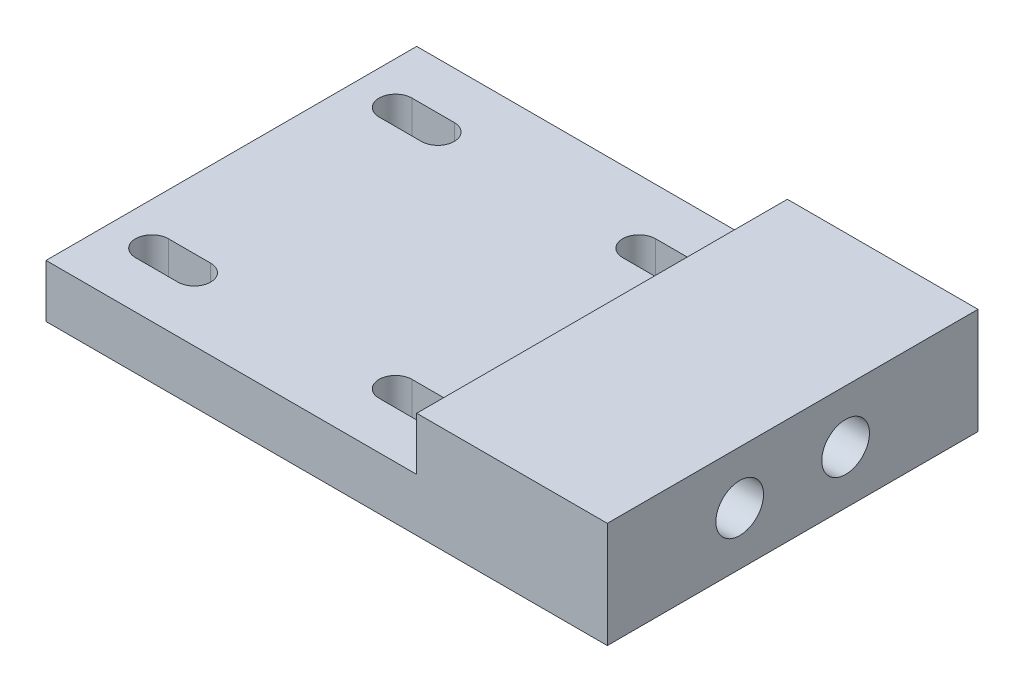
ISO-10303-21;
HEADER;
FILE_DESCRIPTION(('STEP AP214'),'2;1');
FILE_NAME('part.step','',(''),(''),'','','');
FILE_SCHEMA(('AUTOMOTIVE_DESIGN { 1 0 10303 214 1 1 1 1 }'));
ENDSEC;
DATA;
#1=APPLICATION_CONTEXT('core data for automotive mechanical design processes');
#2=APPLICATION_PROTOCOL_DEFINITION('international standard','automotive_design',2000,#1);
#3=PRODUCT_CONTEXT('',#1,'mechanical');
#4=PRODUCT('Part','Part','',(#3));
#5=PRODUCT_RELATED_PRODUCT_CATEGORY('part','',(#4));
#6=PRODUCT_DEFINITION_FORMATION('','',#4);
#7=PRODUCT_DEFINITION_CONTEXT('part definition',#1,'design');
#8=PRODUCT_DEFINITION('design','',#6,#7);
#9=PRODUCT_DEFINITION_SHAPE('','',#8);
#10=(LENGTH_UNIT() NAMED_UNIT(*) SI_UNIT(.MILLI.,.METRE.));
#11=(NAMED_UNIT(*) PLANE_ANGLE_UNIT() SI_UNIT($,.RADIAN.));
#12=(NAMED_UNIT(*) SI_UNIT($,.STERADIAN.) SOLID_ANGLE_UNIT());
#13=UNCERTAINTY_MEASURE_WITH_UNIT(LENGTH_MEASURE(1.E-05),#10,'distance_accuracy_value','');
#14=(GEOMETRIC_REPRESENTATION_CONTEXT(3) GLOBAL_UNCERTAINTY_ASSIGNED_CONTEXT((#13)) GLOBAL_UNIT_ASSIGNED_CONTEXT((#10,
#11,#12)) REPRESENTATION_CONTEXT('',''));
#15=CARTESIAN_POINT('',(0.,0.,0.));
#16=DIRECTION('',(0.,0.,1.));
#17=DIRECTION('',(1.,0.,0.));
#18=AXIS2_PLACEMENT_3D('',#15,#16,#17);
#19=CARTESIAN_POINT('',(26.5,5.,35.));
#20=DIRECTION('',(-1.,0.,0.));
#21=DIRECTION('',(0.,-1.,0.));
#22=AXIS2_PLACEMENT_3D('',#19,#20,#21);
#23=PLANE('',#22);
#24=CARTESIAN_POINT('',(26.5,0.,12.5));
#25=DIRECTION('',(1.,0.,0.));
#26=DIRECTION('',(0.,1.,0.));
#27=AXIS2_PLACEMENT_3D('',#24,#25,#26);
#28=CIRCLE('',#27,2.25);
#29=CARTESIAN_POINT('',(26.5,2.25000000000001,12.5));
#30=VERTEX_POINT('',#29);
#31=EDGE_CURVE('E301',#30,#30,#28,.T.);
#32=ORIENTED_EDGE('',*,*,#31,.F.);
#33=EDGE_LOOP('',(#32));
#34=FACE_BOUND('',#33,.T.);
#35=CARTESIAN_POINT('',(26.5,0.,22.5));
#36=DIRECTION('',(1.,0.,0.));
#37=DIRECTION('',(0.,1.,0.));
#38=AXIS2_PLACEMENT_3D('',#35,#36,#37);
#39=CIRCLE('',#38,2.25);
#40=CARTESIAN_POINT('',(26.5,2.25000000000001,22.5));
#41=VERTEX_POINT('',#40);
#42=EDGE_CURVE('E305',#41,#41,#39,.T.);
#43=ORIENTED_EDGE('',*,*,#42,.F.);
#44=EDGE_LOOP('',(#43));
#45=FACE_BOUND('',#44,.T.);
#46=DIRECTION('',(0.,1.,0.));
#47=VECTOR('',#46,1.);
#48=CARTESIAN_POINT('',(26.5,5.,0.));
#49=LINE('',#48,#47);
#50=CARTESIAN_POINT('',(26.5,-5.,0.));
#51=VERTEX_POINT('',#50);
#52=CARTESIAN_POINT('',(26.5,5.,0.));
#53=VERTEX_POINT('',#52);
#54=EDGE_CURVE('E311',#51,#53,#49,.T.);
#55=ORIENTED_EDGE('',*,*,#54,.T.);
#56=DIRECTION('',(0.,0.,-1.));
#57=VECTOR('',#56,1.);
#58=CARTESIAN_POINT('',(26.5,5.,35.));
#59=LINE('',#58,#57);
#60=CARTESIAN_POINT('',(26.5,5.,35.));
#61=VERTEX_POINT('',#60);
#62=EDGE_CURVE('E11',#61,#53,#59,.T.);
#63=ORIENTED_EDGE('',*,*,#62,.F.);
#64=DIRECTION('',(0.,1.,0.));
#65=VECTOR('',#64,1.);
#66=CARTESIAN_POINT('',(26.5,5.,35.));
#67=LINE('',#66,#65);
#68=CARTESIAN_POINT('',(26.5,-5.,35.));
#69=VERTEX_POINT('',#68);
#70=EDGE_CURVE('E314',#69,#61,#67,.T.);
#71=ORIENTED_EDGE('',*,*,#70,.F.);
#72=DIRECTION('',(0.,0.,-1.));
#73=VECTOR('',#72,1.);
#74=CARTESIAN_POINT('',(26.5,-5.,35.));
#75=LINE('',#74,#73);
#76=EDGE_CURVE('E328',#69,#51,#75,.T.);
#77=ORIENTED_EDGE('',*,*,#76,.T.);
#78=EDGE_LOOP('',(#55,#63,#71,#77));
#79=FACE_BOUND('',#78,.T.);
#80=ADVANCED_FACE('F35',(#34,#45,#79),#23,.F.);
#81=CARTESIAN_POINT('',(8.50000000000001,5.,35.));
#82=DIRECTION('',(0.,-1.,0.));
#83=DIRECTION('',(1.,0.,0.));
#84=AXIS2_PLACEMENT_3D('',#81,#82,#83);
#85=PLANE('',#84);
#86=DIRECTION('',(-1.,0.,0.));
#87=VECTOR('',#86,1.);
#88=CARTESIAN_POINT('',(8.50000000000001,5.,0.));
#89=LINE('',#88,#87);
#90=CARTESIAN_POINT('',(8.50000000000001,5.,0.));
#91=VERTEX_POINT('',#90);
#92=EDGE_CURVE('E331',#53,#91,#89,.T.);
#93=ORIENTED_EDGE('',*,*,#92,.T.);
#94=DIRECTION('',(0.,0.,-1.));
#95=VECTOR('',#94,1.);
#96=CARTESIAN_POINT('',(8.50000000000001,5.,35.));
#97=LINE('',#96,#95);
#98=CARTESIAN_POINT('',(8.50000000000001,5.,35.));
#99=VERTEX_POINT('',#98);
#100=EDGE_CURVE('E42',#99,#91,#97,.T.);
#101=ORIENTED_EDGE('',*,*,#100,.F.);
#102=DIRECTION('',(-1.,0.,0.));
#103=VECTOR('',#102,1.);
#104=CARTESIAN_POINT('',(8.50000000000001,5.,35.));
#105=LINE('',#104,#103);
#106=EDGE_CURVE('E317',#61,#99,#105,.T.);
#107=ORIENTED_EDGE('',*,*,#106,.F.);
#108=ORIENTED_EDGE('',*,*,#62,.T.);
#109=EDGE_LOOP('',(#93,#101,#107,#108));
#110=FACE_BOUND('',#109,.T.);
#111=ADVANCED_FACE('F377',(#110),#85,.F.);
#112=CARTESIAN_POINT('',(8.50000000000001,5.,35.));
#113=DIRECTION('',(1.,0.,0.));
#114=DIRECTION('',(0.,1.,0.));
#115=AXIS2_PLACEMENT_3D('',#112,#113,#114);
#116=PLANE('',#115);
#117=DIRECTION('',(0.,-1.,0.));
#118=VECTOR('',#117,1.);
#119=CARTESIAN_POINT('',(8.50000000000001,5.,0.));
#120=LINE('',#119,#118);
#121=CARTESIAN_POINT('',(8.50000000000001,0.,0.));
#122=VERTEX_POINT('',#121);
#123=EDGE_CURVE('E333',#91,#122,#120,.T.);
#124=ORIENTED_EDGE('',*,*,#123,.T.);
#125=DIRECTION('',(0.,0.,-1.));
#126=VECTOR('',#125,1.);
#127=CARTESIAN_POINT('',(8.50000000000001,0.,35.));
#128=LINE('',#127,#126);
#129=CARTESIAN_POINT('',(8.50000000000001,0.,35.));
#130=VERTEX_POINT('',#129);
#131=EDGE_CURVE('E348',#130,#122,#128,.T.);
#132=ORIENTED_EDGE('',*,*,#131,.F.);
#133=DIRECTION('',(0.,-1.,0.));
#134=VECTOR('',#133,1.);
#135=CARTESIAN_POINT('',(8.50000000000001,5.,35.));
#136=LINE('',#135,#134);
#137=EDGE_CURVE('E320',#99,#130,#136,.T.);
#138=ORIENTED_EDGE('',*,*,#137,.F.);
#139=ORIENTED_EDGE('',*,*,#100,.T.);
#140=EDGE_LOOP('',(#124,#132,#138,#139));
#141=FACE_BOUND('',#140,.T.);
#142=ADVANCED_FACE('F355',(#141),#116,.F.);
#143=CARTESIAN_POINT('',(8.50000000000001,0.,35.));
#144=DIRECTION('',(0.,-1.,0.));
#145=DIRECTION('',(1.,0.,0.));
#146=AXIS2_PLACEMENT_3D('',#143,#144,#145);
#147=PLANE('',#146);
#148=DIRECTION('',(1.,0.,0.));
#149=VECTOR('',#148,1.);
#150=CARTESIAN_POINT('',(4.50000000000002,0.,7.55));
#151=LINE('',#150,#149);
#152=CARTESIAN_POINT('',(0.500000000000018,0.,7.55));
#153=VERTEX_POINT('',#152);
#154=CARTESIAN_POINT('',(4.50000000000002,0.,7.55));
#155=VERTEX_POINT('',#154);
#156=EDGE_CURVE('E195',#153,#155,#151,.T.);
#157=ORIENTED_EDGE('',*,*,#156,.F.);
#158=CARTESIAN_POINT('',(0.500000000000018,0.,6.));
#159=DIRECTION('',(0.,1.,0.));
#160=DIRECTION('',(-1.,0.,0.));
#161=AXIS2_PLACEMENT_3D('',#158,#159,#160);
#162=CIRCLE('',#161,1.55);
#163=CARTESIAN_POINT('',(0.500000000000018,0.,4.45));
#164=VERTEX_POINT('',#163);
#165=EDGE_CURVE('E49',#164,#153,#162,.T.);
#166=ORIENTED_EDGE('',*,*,#165,.F.);
#167=DIRECTION('',(-1.,0.,0.));
#168=VECTOR('',#167,1.);
#169=CARTESIAN_POINT('',(4.50000000000002,0.,4.45));
#170=LINE('',#169,#168);
#171=CARTESIAN_POINT('',(4.50000000000002,0.,4.45));
#172=VERTEX_POINT('',#171);
#173=EDGE_CURVE('E202',#172,#164,#170,.T.);
#174=ORIENTED_EDGE('',*,*,#173,.F.);
#175=CARTESIAN_POINT('',(4.50000000000002,0.,6.));
#176=DIRECTION('',(0.,1.,0.));
#177=DIRECTION('',(1.,0.,0.));
#178=AXIS2_PLACEMENT_3D('',#175,#176,#177);
#179=CIRCLE('',#178,1.55);
#180=EDGE_CURVE('E186',#155,#172,#179,.T.);
#181=ORIENTED_EDGE('',*,*,#180,.F.);
#182=EDGE_LOOP('',(#157,#166,#174,#181));
#183=FACE_BOUND('',#182,.T.);
#184=DIRECTION('',(-1.,0.,0.));
#185=VECTOR('',#184,1.);
#186=CARTESIAN_POINT('',(4.50000000000002,0.,27.45));
#187=LINE('',#186,#185);
#188=CARTESIAN_POINT('',(4.50000000000002,0.,27.45));
#189=VERTEX_POINT('',#188);
#190=CARTESIAN_POINT('',(0.500000000000017,0.,27.45));
#191=VERTEX_POINT('',#190);
#192=EDGE_CURVE('E225',#189,#191,#187,.T.);
#193=ORIENTED_EDGE('',*,*,#192,.F.);
#194=CARTESIAN_POINT('',(4.50000000000002,0.,29.));
#195=DIRECTION('',(0.,1.,0.));
#196=DIRECTION('',(-1.,0.,0.));
#197=AXIS2_PLACEMENT_3D('',#194,#195,#196);
#198=CIRCLE('',#197,1.55);
#199=CARTESIAN_POINT('',(4.50000000000002,0.,30.55));
#200=VERTEX_POINT('',#199);
#201=EDGE_CURVE('E213',#200,#189,#198,.T.);
#202=ORIENTED_EDGE('',*,*,#201,.F.);
#203=DIRECTION('',(1.,0.,0.));
#204=VECTOR('',#203,1.);
#205=CARTESIAN_POINT('',(4.50000000000002,0.,30.55));
#206=LINE('',#205,#204);
#207=CARTESIAN_POINT('',(0.500000000000018,0.,30.55));
#208=VERTEX_POINT('',#207);
#209=EDGE_CURVE('E231',#208,#200,#206,.T.);
#210=ORIENTED_EDGE('',*,*,#209,.F.);
#211=CARTESIAN_POINT('',(0.500000000000018,0.,29.));
#212=DIRECTION('',(0.,1.,0.));
#213=DIRECTION('',(1.,0.,0.));
#214=AXIS2_PLACEMENT_3D('',#211,#212,#213);
#215=CIRCLE('',#214,1.55);
#216=EDGE_CURVE('E228',#191,#208,#215,.T.);
#217=ORIENTED_EDGE('',*,*,#216,.F.);
#218=EDGE_LOOP('',(#193,#202,#210,#217));
#219=FACE_BOUND('',#218,.T.);
#220=DIRECTION('',(1.,0.,0.));
#221=VECTOR('',#220,1.);
#222=CARTESIAN_POINT('',(-22.5,0.,30.55));
#223=LINE('',#222,#221);
#224=CARTESIAN_POINT('',(-22.5,0.,30.55));
#225=VERTEX_POINT('',#224);
#226=CARTESIAN_POINT('',(-18.5,0.,30.55));
#227=VERTEX_POINT('',#226);
#228=EDGE_CURVE('E254',#225,#227,#223,.T.);
#229=ORIENTED_EDGE('',*,*,#228,.F.);
#230=CARTESIAN_POINT('',(-22.5,0.,29.));
#231=DIRECTION('',(0.,1.,0.));
#232=DIRECTION('',(1.,0.,0.));
#233=AXIS2_PLACEMENT_3D('',#230,#231,#232);
#234=CIRCLE('',#233,1.55);
#235=CARTESIAN_POINT('',(-22.5,0.,27.45));
#236=VERTEX_POINT('',#235);
#237=EDGE_CURVE('E243',#236,#225,#234,.T.);
#238=ORIENTED_EDGE('',*,*,#237,.F.);
#239=DIRECTION('',(-1.,0.,0.));
#240=VECTOR('',#239,1.);
#241=CARTESIAN_POINT('',(-22.5,0.,27.45));
#242=LINE('',#241,#240);
#243=CARTESIAN_POINT('',(-18.5,0.,27.45));
#244=VERTEX_POINT('',#243);
#245=EDGE_CURVE('E260',#244,#236,#242,.T.);
#246=ORIENTED_EDGE('',*,*,#245,.F.);
#247=CARTESIAN_POINT('',(-18.5,0.,29.));
#248=DIRECTION('',(0.,1.,0.));
#249=DIRECTION('',(-1.,0.,0.));
#250=AXIS2_PLACEMENT_3D('',#247,#248,#249);
#251=CIRCLE('',#250,1.55);
#252=EDGE_CURVE('E257',#227,#244,#251,.T.);
#253=ORIENTED_EDGE('',*,*,#252,.F.);
#254=EDGE_LOOP('',(#229,#238,#246,#253));
#255=FACE_BOUND('',#254,.T.);
#256=DIRECTION('',(1.,0.,0.));
#257=VECTOR('',#256,1.);
#258=CARTESIAN_POINT('',(-22.5,0.,7.55));
#259=LINE('',#258,#257);
#260=CARTESIAN_POINT('',(-22.5,0.,7.55));
#261=VERTEX_POINT('',#260);
#262=CARTESIAN_POINT('',(-18.5,0.,7.55));
#263=VERTEX_POINT('',#262);
#264=EDGE_CURVE('E283',#261,#263,#259,.T.);
#265=ORIENTED_EDGE('',*,*,#264,.F.);
#266=CARTESIAN_POINT('',(-22.5,0.,6.));
#267=DIRECTION('',(0.,1.,0.));
#268=DIRECTION('',(-1.,0.,0.));
#269=AXIS2_PLACEMENT_3D('',#266,#267,#268);
#270=CIRCLE('',#269,1.55);
#271=CARTESIAN_POINT('',(-22.5,0.,4.45));
#272=VERTEX_POINT('',#271);
#273=EDGE_CURVE('E272',#272,#261,#270,.T.);
#274=ORIENTED_EDGE('',*,*,#273,.F.);
#275=DIRECTION('',(-1.,0.,0.));
#276=VECTOR('',#275,1.);
#277=CARTESIAN_POINT('',(-22.5,0.,4.45));
#278=LINE('',#277,#276);
#279=CARTESIAN_POINT('',(-18.5,0.,4.45));
#280=VERTEX_POINT('',#279);
#281=EDGE_CURVE('E289',#280,#272,#278,.T.);
#282=ORIENTED_EDGE('',*,*,#281,.F.);
#283=CARTESIAN_POINT('',(-18.5,0.,6.));
#284=DIRECTION('',(0.,1.,0.));
#285=DIRECTION('',(1.,0.,0.));
#286=AXIS2_PLACEMENT_3D('',#283,#284,#285);
#287=CIRCLE('',#286,1.55);
#288=EDGE_CURVE('E286',#263,#280,#287,.T.);
#289=ORIENTED_EDGE('',*,*,#288,.F.);
#290=EDGE_LOOP('',(#265,#274,#282,#289));
#291=FACE_BOUND('',#290,.T.);
#292=DIRECTION('',(-1.,0.,0.));
#293=VECTOR('',#292,1.);
#294=CARTESIAN_POINT('',(8.50000000000001,0.,0.));
#295=LINE('',#294,#293);
#296=CARTESIAN_POINT('',(-26.5,0.,0.));
#297=VERTEX_POINT('',#296);
#298=EDGE_CURVE('E335',#122,#297,#295,.T.);
#299=ORIENTED_EDGE('',*,*,#298,.T.);
#300=DIRECTION('',(0.,0.,-1.));
#301=VECTOR('',#300,1.);
#302=CARTESIAN_POINT('',(-26.5,0.,35.));
#303=LINE('',#302,#301);
#304=CARTESIAN_POINT('',(-26.5,0.,35.));
#305=VERTEX_POINT('',#304);
#306=EDGE_CURVE('E345',#305,#297,#303,.T.);
#307=ORIENTED_EDGE('',*,*,#306,.F.);
#308=DIRECTION('',(-1.,0.,0.));
#309=VECTOR('',#308,1.);
#310=CARTESIAN_POINT('',(8.50000000000001,0.,35.));
#311=LINE('',#310,#309);
#312=EDGE_CURVE('E322',#130,#305,#311,.T.);
#313=ORIENTED_EDGE('',*,*,#312,.F.);
#314=ORIENTED_EDGE('',*,*,#131,.T.);
#315=EDGE_LOOP('',(#299,#307,#313,#314));
#316=FACE_BOUND('',#315,.T.);
#317=ADVANCED_FACE('F199',(#183,#219,#255,#291,#316),#147,.F.);
#318=CARTESIAN_POINT('',(-26.5,0.,35.));
#319=DIRECTION('',(1.,0.,0.));
#320=DIRECTION('',(0.,0.,-1.));
#321=AXIS2_PLACEMENT_3D('',#318,#319,#320);
#322=PLANE('',#321);
#323=DIRECTION('',(0.,-1.,0.));
#324=VECTOR('',#323,1.);
#325=CARTESIAN_POINT('',(-26.5,0.,0.));
#326=LINE('',#325,#324);
#327=CARTESIAN_POINT('',(-26.5,-5.,0.));
#328=VERTEX_POINT('',#327);
#329=EDGE_CURVE('E337',#297,#328,#326,.T.);
#330=ORIENTED_EDGE('',*,*,#329,.T.);
#331=DIRECTION('',(0.,0.,-1.));
#332=VECTOR('',#331,1.);
#333=CARTESIAN_POINT('',(-26.5,-5.,35.));
#334=LINE('',#333,#332);
#335=CARTESIAN_POINT('',(-26.5,-5.,35.));
#336=VERTEX_POINT('',#335);
#337=EDGE_CURVE('E342',#336,#328,#334,.T.);
#338=ORIENTED_EDGE('',*,*,#337,.F.);
#339=DIRECTION('',(0.,-1.,0.));
#340=VECTOR('',#339,1.);
#341=CARTESIAN_POINT('',(-26.5,0.,35.));
#342=LINE('',#341,#340);
#343=EDGE_CURVE('E324',#305,#336,#342,.T.);
#344=ORIENTED_EDGE('',*,*,#343,.F.);
#345=ORIENTED_EDGE('',*,*,#306,.T.);
#346=EDGE_LOOP('',(#330,#338,#344,#345));
#347=FACE_BOUND('',#346,.T.);
#348=ADVANCED_FACE('F369',(#347),#322,.F.);
#349=CARTESIAN_POINT('',(-26.5,-5.,35.));
#350=DIRECTION('',(0.,1.,0.));
#351=DIRECTION('',(0.,0.,1.));
#352=AXIS2_PLACEMENT_3D('',#349,#350,#351);
#353=PLANE('',#352);
#354=DIRECTION('',(1.,0.,0.));
#355=VECTOR('',#354,1.);
#356=CARTESIAN_POINT('',(4.50000000000002,-5.,4.45));
#357=LINE('',#356,#355);
#358=CARTESIAN_POINT('',(0.500000000000018,-5.,4.45));
#359=VERTEX_POINT('',#358);
#360=CARTESIAN_POINT('',(4.50000000000002,-5.,4.45));
#361=VERTEX_POINT('',#360);
#362=EDGE_CURVE('E484',#359,#361,#357,.T.);
#363=ORIENTED_EDGE('',*,*,#362,.F.);
#364=CARTESIAN_POINT('',(0.500000000000018,-5.,6.));
#365=DIRECTION('',(0.,1.,0.));
#366=DIRECTION('',(0.,0.,1.));
#367=AXIS2_PLACEMENT_3D('',#364,#365,#366);
#368=CIRCLE('',#367,1.55);
#369=CARTESIAN_POINT('',(0.500000000000018,-5.,7.55));
#370=VERTEX_POINT('',#369);
#371=EDGE_CURVE('E214',#370,#359,#368,.F.);
#372=ORIENTED_EDGE('',*,*,#371,.F.);
#373=DIRECTION('',(-1.,0.,0.));
#374=VECTOR('',#373,1.);
#375=CARTESIAN_POINT('',(4.50000000000002,-5.,7.55));
#376=LINE('',#375,#374);
#377=CARTESIAN_POINT('',(4.50000000000002,-5.,7.55));
#378=VERTEX_POINT('',#377);
#379=EDGE_CURVE('E211',#378,#370,#376,.T.);
#380=ORIENTED_EDGE('',*,*,#379,.F.);
#381=CARTESIAN_POINT('',(4.50000000000002,-5.,6.));
#382=DIRECTION('',(0.,1.,0.));
#383=DIRECTION('',(0.,0.,1.));
#384=AXIS2_PLACEMENT_3D('',#381,#382,#383);
#385=CIRCLE('',#384,1.55);
#386=EDGE_CURVE('E189',#361,#378,#385,.F.);
#387=ORIENTED_EDGE('',*,*,#386,.F.);
#388=EDGE_LOOP('',(#363,#372,#380,#387));
#389=FACE_BOUND('',#388,.T.);
#390=DIRECTION('',(-1.,0.,0.));
#391=VECTOR('',#390,1.);
#392=CARTESIAN_POINT('',(4.50000000000002,-5.,30.55));
#393=LINE('',#392,#391);
#394=CARTESIAN_POINT('',(4.50000000000002,-5.,30.55));
#395=VERTEX_POINT('',#394);
#396=CARTESIAN_POINT('',(0.500000000000018,-5.,30.55));
#397=VERTEX_POINT('',#396);
#398=EDGE_CURVE('E218',#395,#397,#393,.T.);
#399=ORIENTED_EDGE('',*,*,#398,.F.);
#400=CARTESIAN_POINT('',(4.50000000000002,-5.,29.));
#401=DIRECTION('',(0.,1.,0.));
#402=DIRECTION('',(0.,0.,1.));
#403=AXIS2_PLACEMENT_3D('',#400,#401,#402);
#404=CIRCLE('',#403,1.55);
#405=CARTESIAN_POINT('',(4.50000000000002,-5.,27.45));
#406=VERTEX_POINT('',#405);
#407=EDGE_CURVE('E221',#406,#395,#404,.F.);
#408=ORIENTED_EDGE('',*,*,#407,.F.);
#409=DIRECTION('',(1.,0.,0.));
#410=VECTOR('',#409,1.);
#411=CARTESIAN_POINT('',(4.50000000000002,-5.,27.45));
#412=LINE('',#411,#410);
#413=CARTESIAN_POINT('',(0.500000000000018,-5.,27.45));
#414=VERTEX_POINT('',#413);
#415=EDGE_CURVE('E223',#414,#406,#412,.T.);
#416=ORIENTED_EDGE('',*,*,#415,.F.);
#417=CARTESIAN_POINT('',(0.500000000000018,-5.,29.));
#418=DIRECTION('',(0.,1.,0.));
#419=DIRECTION('',(0.,0.,1.));
#420=AXIS2_PLACEMENT_3D('',#417,#418,#419);
#421=CIRCLE('',#420,1.55);
#422=EDGE_CURVE('E215',#397,#414,#421,.F.);
#423=ORIENTED_EDGE('',*,*,#422,.F.);
#424=EDGE_LOOP('',(#399,#408,#416,#423));
#425=FACE_BOUND('',#424,.T.);
#426=DIRECTION('',(1.,0.,0.));
#427=VECTOR('',#426,1.);
#428=CARTESIAN_POINT('',(-22.5,-5.,27.45));
#429=LINE('',#428,#427);
#430=CARTESIAN_POINT('',(-22.5,-5.,27.45));
#431=VERTEX_POINT('',#430);
#432=CARTESIAN_POINT('',(-18.5,-5.,27.45));
#433=VERTEX_POINT('',#432);
#434=EDGE_CURVE('E247',#431,#433,#429,.T.);
#435=ORIENTED_EDGE('',*,*,#434,.F.);
#436=CARTESIAN_POINT('',(-22.5,-5.,29.));
#437=DIRECTION('',(0.,1.,0.));
#438=DIRECTION('',(0.,0.,1.));
#439=AXIS2_PLACEMENT_3D('',#436,#437,#438);
#440=CIRCLE('',#439,1.55);
#441=CARTESIAN_POINT('',(-22.5,-5.,30.55));
#442=VERTEX_POINT('',#441);
#443=EDGE_CURVE('E250',#442,#431,#440,.F.);
#444=ORIENTED_EDGE('',*,*,#443,.F.);
#445=DIRECTION('',(-1.,0.,0.));
#446=VECTOR('',#445,1.);
#447=CARTESIAN_POINT('',(-22.5,-5.,30.55));
#448=LINE('',#447,#446);
#449=CARTESIAN_POINT('',(-18.5,-5.,30.55));
#450=VERTEX_POINT('',#449);
#451=EDGE_CURVE('E252',#450,#442,#448,.T.);
#452=ORIENTED_EDGE('',*,*,#451,.F.);
#453=CARTESIAN_POINT('',(-18.5,-5.,29.));
#454=DIRECTION('',(0.,1.,0.));
#455=DIRECTION('',(0.,0.,1.));
#456=AXIS2_PLACEMENT_3D('',#453,#454,#455);
#457=CIRCLE('',#456,1.55);
#458=EDGE_CURVE('E244',#433,#450,#457,.F.);
#459=ORIENTED_EDGE('',*,*,#458,.F.);
#460=EDGE_LOOP('',(#435,#444,#452,#459));
#461=FACE_BOUND('',#460,.T.);
#462=DIRECTION('',(1.,0.,0.));
#463=VECTOR('',#462,1.);
#464=CARTESIAN_POINT('',(-22.5,-5.,4.45));
#465=LINE('',#464,#463);
#466=CARTESIAN_POINT('',(-22.5,-5.,4.45));
#467=VERTEX_POINT('',#466);
#468=CARTESIAN_POINT('',(-18.5,-5.,4.45));
#469=VERTEX_POINT('',#468);
#470=EDGE_CURVE('E276',#467,#469,#465,.T.);
#471=ORIENTED_EDGE('',*,*,#470,.F.);
#472=CARTESIAN_POINT('',(-22.5,-5.,6.));
#473=DIRECTION('',(0.,1.,0.));
#474=DIRECTION('',(0.,0.,1.));
#475=AXIS2_PLACEMENT_3D('',#472,#473,#474);
#476=CIRCLE('',#475,1.55);
#477=CARTESIAN_POINT('',(-22.5,-5.,7.55));
#478=VERTEX_POINT('',#477);
#479=EDGE_CURVE('E279',#478,#467,#476,.F.);
#480=ORIENTED_EDGE('',*,*,#479,.F.);
#481=DIRECTION('',(-1.,0.,0.));
#482=VECTOR('',#481,1.);
#483=CARTESIAN_POINT('',(-22.5,-5.,7.55));
#484=LINE('',#483,#482);
#485=CARTESIAN_POINT('',(-18.5,-5.,7.55));
#486=VERTEX_POINT('',#485);
#487=EDGE_CURVE('E281',#486,#478,#484,.T.);
#488=ORIENTED_EDGE('',*,*,#487,.F.);
#489=CARTESIAN_POINT('',(-18.5,-5.,6.));
#490=DIRECTION('',(0.,1.,0.));
#491=DIRECTION('',(0.,0.,1.));
#492=AXIS2_PLACEMENT_3D('',#489,#490,#491);
#493=CIRCLE('',#492,1.55);
#494=EDGE_CURVE('E273',#469,#486,#493,.F.);
#495=ORIENTED_EDGE('',*,*,#494,.F.);
#496=EDGE_LOOP('',(#471,#480,#488,#495));
#497=FACE_BOUND('',#496,.T.);
#498=DIRECTION('',(1.,0.,0.));
#499=VECTOR('',#498,1.);
#500=CARTESIAN_POINT('',(-26.5,-5.,0.));
#501=LINE('',#500,#499);
#502=EDGE_CURVE('E318',#328,#51,#501,.T.);
#503=ORIENTED_EDGE('',*,*,#502,.T.);
#504=ORIENTED_EDGE('',*,*,#76,.F.);
#505=DIRECTION('',(1.,0.,0.));
#506=VECTOR('',#505,1.);
#507=CARTESIAN_POINT('',(-26.5,-5.,35.));
#508=LINE('',#507,#506);
#509=EDGE_CURVE('E326',#336,#69,#508,.T.);
#510=ORIENTED_EDGE('',*,*,#509,.F.);
#511=ORIENTED_EDGE('',*,*,#337,.T.);
#512=EDGE_LOOP('',(#503,#504,#510,#511));
#513=FACE_BOUND('',#512,.T.);
#514=ADVANCED_FACE('F380',(#389,#425,#461,#497,#513),#353,.F.);
#515=CARTESIAN_POINT('',(0.,0.,35.));
#516=DIRECTION('',(0.,0.,1.));
#517=DIRECTION('',(1.,0.,0.));
#518=AXIS2_PLACEMENT_3D('',#515,#516,#517);
#519=PLANE('',#518);
#520=ORIENTED_EDGE('',*,*,#70,.T.);
#521=ORIENTED_EDGE('',*,*,#106,.T.);
#522=ORIENTED_EDGE('',*,*,#137,.T.);
#523=ORIENTED_EDGE('',*,*,#312,.T.);
#524=ORIENTED_EDGE('',*,*,#343,.T.);
#525=ORIENTED_EDGE('',*,*,#509,.T.);
#526=EDGE_LOOP('',(#520,#521,#522,#523,#524,#525));
#527=FACE_BOUND('',#526,.T.);
#528=ADVANCED_FACE('F373',(#527),#519,.T.);
#529=CARTESIAN_POINT('',(0.,0.,0.));
#530=DIRECTION('',(0.,0.,1.));
#531=DIRECTION('',(1.,0.,0.));
#532=AXIS2_PLACEMENT_3D('',#529,#530,#531);
#533=PLANE('',#532);
#534=ORIENTED_EDGE('',*,*,#54,.F.);
#535=ORIENTED_EDGE('',*,*,#502,.F.);
#536=ORIENTED_EDGE('',*,*,#329,.F.);
#537=ORIENTED_EDGE('',*,*,#298,.F.);
#538=ORIENTED_EDGE('',*,*,#123,.F.);
#539=ORIENTED_EDGE('',*,*,#92,.F.);
#540=EDGE_LOOP('',(#534,#535,#536,#537,#538,#539));
#541=FACE_BOUND('',#540,.T.);
#542=ADVANCED_FACE('F361',(#541),#533,.F.);
#543=CARTESIAN_POINT('',(16.5,0.,22.5));
#544=DIRECTION('',(1.,0.,0.));
#545=DIRECTION('',(0.,1.,0.));
#546=AXIS2_PLACEMENT_3D('',#543,#544,#545);
#547=CYLINDRICAL_SURFACE('',#546,2.25);
#548=CARTESIAN_POINT('',(16.5,0.,22.5));
#549=DIRECTION('',(1.,0.,0.));
#550=DIRECTION('',(0.,1.,0.));
#551=AXIS2_PLACEMENT_3D('',#548,#549,#550);
#552=CIRCLE('',#551,2.25);
#553=CARTESIAN_POINT('',(16.5,2.25,22.5));
#554=VERTEX_POINT('',#553);
#555=EDGE_CURVE('E308',#554,#554,#552,.T.);
#556=ORIENTED_EDGE('',*,*,#555,.F.);
#557=EDGE_LOOP('',(#556));
#558=FACE_BOUND('',#557,.T.);
#559=ORIENTED_EDGE('',*,*,#42,.T.);
#560=EDGE_LOOP('',(#559));
#561=FACE_BOUND('',#560,.T.);
#562=ADVANCED_FACE('F402',(#558,#561),#547,.F.);
#563=CARTESIAN_POINT('',(16.5,0.,22.5));
#564=DIRECTION('',(1.,0.,0.));
#565=DIRECTION('',(0.,1.,0.));
#566=AXIS2_PLACEMENT_3D('',#563,#564,#565);
#567=PLANE('',#566);
#568=ORIENTED_EDGE('',*,*,#555,.T.);
#569=EDGE_LOOP('',(#568));
#570=FACE_BOUND('',#569,.T.);
#571=ADVANCED_FACE('F404',(#570),#567,.T.);
#572=CARTESIAN_POINT('',(16.5,0.,12.5));
#573=DIRECTION('',(1.,0.,0.));
#574=DIRECTION('',(0.,1.,0.));
#575=AXIS2_PLACEMENT_3D('',#572,#573,#574);
#576=CYLINDRICAL_SURFACE('',#575,2.25);
#577=CARTESIAN_POINT('',(16.5,0.,12.5));
#578=DIRECTION('',(1.,0.,0.));
#579=DIRECTION('',(0.,1.,0.));
#580=AXIS2_PLACEMENT_3D('',#577,#578,#579);
#581=CIRCLE('',#580,2.25);
#582=CARTESIAN_POINT('',(16.5,2.25000000000001,12.5));
#583=VERTEX_POINT('',#582);
#584=EDGE_CURVE('E302',#583,#583,#581,.T.);
#585=ORIENTED_EDGE('',*,*,#584,.F.);
#586=EDGE_LOOP('',(#585));
#587=FACE_BOUND('',#586,.T.);
#588=ORIENTED_EDGE('',*,*,#31,.T.);
#589=EDGE_LOOP('',(#588));
#590=FACE_BOUND('',#589,.T.);
#591=ADVANCED_FACE('F411',(#587,#590),#576,.F.);
#592=CARTESIAN_POINT('',(16.5,0.,12.5));
#593=DIRECTION('',(1.,0.,0.));
#594=DIRECTION('',(0.,1.,0.));
#595=AXIS2_PLACEMENT_3D('',#592,#593,#594);
#596=PLANE('',#595);
#597=ORIENTED_EDGE('',*,*,#584,.T.);
#598=EDGE_LOOP('',(#597));
#599=FACE_BOUND('',#598,.T.);
#600=ADVANCED_FACE('F418',(#599),#596,.T.);
#601=CARTESIAN_POINT('',(-22.5,-12.7472575792986,6.));
#602=DIRECTION('',(0.,1.,0.));
#603=DIRECTION('',(-1.,0.,0.));
#604=AXIS2_PLACEMENT_3D('',#601,#602,#603);
#605=CYLINDRICAL_SURFACE('',#604,1.55);
#606=ORIENTED_EDGE('',*,*,#479,.T.);
#607=DIRECTION('',(0.,1.,0.));
#608=VECTOR('',#607,1.);
#609=CARTESIAN_POINT('',(-22.5,-12.7472575792986,4.45));
#610=LINE('',#609,#608);
#611=EDGE_CURVE('E277',#467,#272,#610,.T.);
#612=ORIENTED_EDGE('',*,*,#611,.T.);
#613=ORIENTED_EDGE('',*,*,#273,.T.);
#614=DIRECTION('',(0.,1.,0.));
#615=VECTOR('',#614,1.);
#616=CARTESIAN_POINT('',(-22.5,-12.7472575792986,7.55));
#617=LINE('',#616,#615);
#618=EDGE_CURVE('E292',#478,#261,#617,.T.);
#619=ORIENTED_EDGE('',*,*,#618,.F.);
#620=EDGE_LOOP('',(#606,#612,#613,#619));
#621=FACE_BOUND('',#620,.T.);
#622=ADVANCED_FACE('F422',(#621),#605,.F.);
#623=CARTESIAN_POINT('',(-22.5,-12.7472575792986,4.45));
#624=DIRECTION('',(0.,0.,-1.));
#625=DIRECTION('',(-1.,0.,0.));
#626=AXIS2_PLACEMENT_3D('',#623,#624,#625);
#627=PLANE('',#626);
#628=ORIENTED_EDGE('',*,*,#470,.T.);
#629=DIRECTION('',(0.,1.,0.));
#630=VECTOR('',#629,1.);
#631=CARTESIAN_POINT('',(-18.5,-12.7472575792986,4.45));
#632=LINE('',#631,#630);
#633=EDGE_CURVE('E294',#469,#280,#632,.T.);
#634=ORIENTED_EDGE('',*,*,#633,.T.);
#635=ORIENTED_EDGE('',*,*,#281,.T.);
#636=ORIENTED_EDGE('',*,*,#611,.F.);
#637=EDGE_LOOP('',(#628,#634,#635,#636));
#638=FACE_BOUND('',#637,.T.);
#639=ADVANCED_FACE('F426',(#638),#627,.F.);
#640=CARTESIAN_POINT('',(-18.5,-12.7472575792986,6.));
#641=DIRECTION('',(0.,1.,0.));
#642=DIRECTION('',(-1.,0.,0.));
#643=AXIS2_PLACEMENT_3D('',#640,#641,#642);
#644=CYLINDRICAL_SURFACE('',#643,1.55);
#645=ORIENTED_EDGE('',*,*,#494,.T.);
#646=DIRECTION('',(0.,1.,0.));
#647=VECTOR('',#646,1.);
#648=CARTESIAN_POINT('',(-18.5,-12.7472575792986,7.55));
#649=LINE('',#648,#647);
#650=EDGE_CURVE('E296',#486,#263,#649,.T.);
#651=ORIENTED_EDGE('',*,*,#650,.T.);
#652=ORIENTED_EDGE('',*,*,#288,.T.);
#653=ORIENTED_EDGE('',*,*,#633,.F.);
#654=EDGE_LOOP('',(#645,#651,#652,#653));
#655=FACE_BOUND('',#654,.T.);
#656=ADVANCED_FACE('F432',(#655),#644,.F.);
#657=CARTESIAN_POINT('',(-22.5,-12.7472575792986,7.55));
#658=DIRECTION('',(0.,0.,1.));
#659=DIRECTION('',(1.,0.,0.));
#660=AXIS2_PLACEMENT_3D('',#657,#658,#659);
#661=PLANE('',#660);
#662=ORIENTED_EDGE('',*,*,#487,.T.);
#663=ORIENTED_EDGE('',*,*,#618,.T.);
#664=ORIENTED_EDGE('',*,*,#264,.T.);
#665=ORIENTED_EDGE('',*,*,#650,.F.);
#666=EDGE_LOOP('',(#662,#663,#664,#665));
#667=FACE_BOUND('',#666,.T.);
#668=ADVANCED_FACE('F428',(#667),#661,.F.);
#669=CARTESIAN_POINT('',(-22.5,-12.7472575792986,29.));
#670=DIRECTION('',(0.,1.,0.));
#671=DIRECTION('',(-1.,0.,0.));
#672=AXIS2_PLACEMENT_3D('',#669,#670,#671);
#673=CYLINDRICAL_SURFACE('',#672,1.55);
#674=ORIENTED_EDGE('',*,*,#443,.T.);
#675=DIRECTION('',(0.,1.,0.));
#676=VECTOR('',#675,1.);
#677=CARTESIAN_POINT('',(-22.5,-12.7472575792986,27.45));
#678=LINE('',#677,#676);
#679=EDGE_CURVE('E248',#431,#236,#678,.T.);
#680=ORIENTED_EDGE('',*,*,#679,.T.);
#681=ORIENTED_EDGE('',*,*,#237,.T.);
#682=DIRECTION('',(0.,1.,0.));
#683=VECTOR('',#682,1.);
#684=CARTESIAN_POINT('',(-22.5,-12.7472575792986,30.55));
#685=LINE('',#684,#683);
#686=EDGE_CURVE('E263',#442,#225,#685,.T.);
#687=ORIENTED_EDGE('',*,*,#686,.F.);
#688=EDGE_LOOP('',(#674,#680,#681,#687));
#689=FACE_BOUND('',#688,.T.);
#690=ADVANCED_FACE('F431',(#689),#673,.F.);
#691=CARTESIAN_POINT('',(-22.5,-12.7472575792986,27.45));
#692=DIRECTION('',(0.,0.,-1.));
#693=DIRECTION('',(-1.,0.,0.));
#694=AXIS2_PLACEMENT_3D('',#691,#692,#693);
#695=PLANE('',#694);
#696=ORIENTED_EDGE('',*,*,#434,.T.);
#697=DIRECTION('',(0.,1.,0.));
#698=VECTOR('',#697,1.);
#699=CARTESIAN_POINT('',(-18.5,-12.7472575792986,27.45));
#700=LINE('',#699,#698);
#701=EDGE_CURVE('E265',#433,#244,#700,.T.);
#702=ORIENTED_EDGE('',*,*,#701,.T.);
#703=ORIENTED_EDGE('',*,*,#245,.T.);
#704=ORIENTED_EDGE('',*,*,#679,.F.);
#705=EDGE_LOOP('',(#696,#702,#703,#704));
#706=FACE_BOUND('',#705,.T.);
#707=ADVANCED_FACE('F442',(#706),#695,.F.);
#708=CARTESIAN_POINT('',(-18.5,-12.7472575792986,29.));
#709=DIRECTION('',(0.,1.,0.));
#710=DIRECTION('',(-1.,0.,0.));
#711=AXIS2_PLACEMENT_3D('',#708,#709,#710);
#712=CYLINDRICAL_SURFACE('',#711,1.55);
#713=ORIENTED_EDGE('',*,*,#458,.T.);
#714=DIRECTION('',(0.,1.,0.));
#715=VECTOR('',#714,1.);
#716=CARTESIAN_POINT('',(-18.5,-12.7472575792986,30.55));
#717=LINE('',#716,#715);
#718=EDGE_CURVE('E267',#450,#227,#717,.T.);
#719=ORIENTED_EDGE('',*,*,#718,.T.);
#720=ORIENTED_EDGE('',*,*,#252,.T.);
#721=ORIENTED_EDGE('',*,*,#701,.F.);
#722=EDGE_LOOP('',(#713,#719,#720,#721));
#723=FACE_BOUND('',#722,.T.);
#724=ADVANCED_FACE('F448',(#723),#712,.F.);
#725=CARTESIAN_POINT('',(-22.5,-12.7472575792986,30.55));
#726=DIRECTION('',(0.,0.,1.));
#727=DIRECTION('',(1.,0.,0.));
#728=AXIS2_PLACEMENT_3D('',#725,#726,#727);
#729=PLANE('',#728);
#730=ORIENTED_EDGE('',*,*,#451,.T.);
#731=ORIENTED_EDGE('',*,*,#686,.T.);
#732=ORIENTED_EDGE('',*,*,#228,.T.);
#733=ORIENTED_EDGE('',*,*,#718,.F.);
#734=EDGE_LOOP('',(#730,#731,#732,#733));
#735=FACE_BOUND('',#734,.T.);
#736=ADVANCED_FACE('F444',(#735),#729,.F.);
#737=CARTESIAN_POINT('',(4.50000000000002,-12.7472575792986,29.));
#738=DIRECTION('',(0.,1.,0.));
#739=DIRECTION('',(-1.,0.,0.));
#740=AXIS2_PLACEMENT_3D('',#737,#738,#739);
#741=CYLINDRICAL_SURFACE('',#740,1.55);
#742=ORIENTED_EDGE('',*,*,#407,.T.);
#743=DIRECTION('',(0.,1.,0.));
#744=VECTOR('',#743,1.);
#745=CARTESIAN_POINT('',(4.50000000000002,-12.7472575792986,30.55));
#746=LINE('',#745,#744);
#747=EDGE_CURVE('E219',#395,#200,#746,.T.);
#748=ORIENTED_EDGE('',*,*,#747,.T.);
#749=ORIENTED_EDGE('',*,*,#201,.T.);
#750=DIRECTION('',(0.,1.,0.));
#751=VECTOR('',#750,1.);
#752=CARTESIAN_POINT('',(4.50000000000002,-12.7472575792986,27.45));
#753=LINE('',#752,#751);
#754=EDGE_CURVE('E234',#406,#189,#753,.T.);
#755=ORIENTED_EDGE('',*,*,#754,.F.);
#756=EDGE_LOOP('',(#742,#748,#749,#755));
#757=FACE_BOUND('',#756,.T.);
#758=ADVANCED_FACE('F447',(#757),#741,.F.);
#759=CARTESIAN_POINT('',(4.50000000000002,-12.7472575792986,30.55));
#760=DIRECTION('',(0.,0.,1.));
#761=DIRECTION('',(1.,0.,0.));
#762=AXIS2_PLACEMENT_3D('',#759,#760,#761);
#763=PLANE('',#762);
#764=ORIENTED_EDGE('',*,*,#398,.T.);
#765=DIRECTION('',(0.,1.,0.));
#766=VECTOR('',#765,1.);
#767=CARTESIAN_POINT('',(0.500000000000019,-12.7472575792986,30.55));
#768=LINE('',#767,#766);
#769=EDGE_CURVE('E236',#397,#208,#768,.T.);
#770=ORIENTED_EDGE('',*,*,#769,.T.);
#771=ORIENTED_EDGE('',*,*,#209,.T.);
#772=ORIENTED_EDGE('',*,*,#747,.F.);
#773=EDGE_LOOP('',(#764,#770,#771,#772));
#774=FACE_BOUND('',#773,.T.);
#775=ADVANCED_FACE('F458',(#774),#763,.F.);
#776=CARTESIAN_POINT('',(0.500000000000019,-12.7472575792986,29.));
#777=DIRECTION('',(0.,1.,0.));
#778=DIRECTION('',(-1.,0.,0.));
#779=AXIS2_PLACEMENT_3D('',#776,#777,#778);
#780=CYLINDRICAL_SURFACE('',#779,1.55);
#781=ORIENTED_EDGE('',*,*,#422,.T.);
#782=DIRECTION('',(0.,1.,0.));
#783=VECTOR('',#782,1.);
#784=CARTESIAN_POINT('',(0.500000000000019,-12.7472575792986,27.45));
#785=LINE('',#784,#783);
#786=EDGE_CURVE('E238',#414,#191,#785,.T.);
#787=ORIENTED_EDGE('',*,*,#786,.T.);
#788=ORIENTED_EDGE('',*,*,#216,.T.);
#789=ORIENTED_EDGE('',*,*,#769,.F.);
#790=EDGE_LOOP('',(#781,#787,#788,#789));
#791=FACE_BOUND('',#790,.T.);
#792=ADVANCED_FACE('F464',(#791),#780,.F.);
#793=CARTESIAN_POINT('',(4.50000000000002,-12.7472575792986,27.45));
#794=DIRECTION('',(0.,0.,-1.));
#795=DIRECTION('',(-1.,0.,0.));
#796=AXIS2_PLACEMENT_3D('',#793,#794,#795);
#797=PLANE('',#796);
#798=ORIENTED_EDGE('',*,*,#415,.T.);
#799=ORIENTED_EDGE('',*,*,#754,.T.);
#800=ORIENTED_EDGE('',*,*,#192,.T.);
#801=ORIENTED_EDGE('',*,*,#786,.F.);
#802=EDGE_LOOP('',(#798,#799,#800,#801));
#803=FACE_BOUND('',#802,.T.);
#804=ADVANCED_FACE('F460',(#803),#797,.F.);
#805=CARTESIAN_POINT('',(0.500000000000019,-12.7472575792986,6.));
#806=DIRECTION('',(0.,1.,0.));
#807=DIRECTION('',(-1.,0.,0.));
#808=AXIS2_PLACEMENT_3D('',#805,#806,#807);
#809=CYLINDRICAL_SURFACE('',#808,1.55);
#810=ORIENTED_EDGE('',*,*,#371,.T.);
#811=DIRECTION('',(0.,1.,0.));
#812=VECTOR('',#811,1.);
#813=CARTESIAN_POINT('',(0.500000000000019,-12.7472575792986,4.45));
#814=LINE('',#813,#812);
#815=EDGE_CURVE('E207',#359,#164,#814,.T.);
#816=ORIENTED_EDGE('',*,*,#815,.T.);
#817=ORIENTED_EDGE('',*,*,#165,.T.);
#818=DIRECTION('',(0.,1.,0.));
#819=VECTOR('',#818,1.);
#820=CARTESIAN_POINT('',(0.500000000000019,-12.7472575792986,7.55));
#821=LINE('',#820,#819);
#822=EDGE_CURVE('E192',#370,#153,#821,.T.);
#823=ORIENTED_EDGE('',*,*,#822,.F.);
#824=EDGE_LOOP('',(#810,#816,#817,#823));
#825=FACE_BOUND('',#824,.T.);
#826=ADVANCED_FACE('F463',(#825),#809,.F.);
#827=CARTESIAN_POINT('',(4.50000000000002,-12.7472575792986,4.45));
#828=DIRECTION('',(0.,0.,-1.));
#829=DIRECTION('',(-1.,0.,0.));
#830=AXIS2_PLACEMENT_3D('',#827,#828,#829);
#831=PLANE('',#830);
#832=ORIENTED_EDGE('',*,*,#362,.T.);
#833=DIRECTION('',(0.,1.,0.));
#834=VECTOR('',#833,1.);
#835=CARTESIAN_POINT('',(4.50000000000002,-12.7472575792986,4.45));
#836=LINE('',#835,#834);
#837=EDGE_CURVE('E191',#361,#172,#836,.T.);
#838=ORIENTED_EDGE('',*,*,#837,.T.);
#839=ORIENTED_EDGE('',*,*,#173,.T.);
#840=ORIENTED_EDGE('',*,*,#815,.F.);
#841=EDGE_LOOP('',(#832,#838,#839,#840));
#842=FACE_BOUND('',#841,.T.);
#843=ADVANCED_FACE('F474',(#842),#831,.F.);
#844=CARTESIAN_POINT('',(4.50000000000002,-12.7472575792986,6.));
#845=DIRECTION('',(0.,1.,0.));
#846=DIRECTION('',(-1.,0.,0.));
#847=AXIS2_PLACEMENT_3D('',#844,#845,#846);
#848=CYLINDRICAL_SURFACE('',#847,1.55);
#849=ORIENTED_EDGE('',*,*,#386,.T.);
#850=DIRECTION('',(0.,1.,0.));
#851=VECTOR('',#850,1.);
#852=CARTESIAN_POINT('',(4.50000000000002,-12.7472575792986,7.55));
#853=LINE('',#852,#851);
#854=EDGE_CURVE('E57',#378,#155,#853,.T.);
#855=ORIENTED_EDGE('',*,*,#854,.T.);
#856=ORIENTED_EDGE('',*,*,#180,.T.);
#857=ORIENTED_EDGE('',*,*,#837,.F.);
#858=EDGE_LOOP('',(#849,#855,#856,#857));
#859=FACE_BOUND('',#858,.T.);
#860=ADVANCED_FACE('F183',(#859),#848,.F.);
#861=CARTESIAN_POINT('',(4.50000000000002,-12.7472575792986,7.55));
#862=DIRECTION('',(0.,0.,1.));
#863=DIRECTION('',(1.,0.,0.));
#864=AXIS2_PLACEMENT_3D('',#861,#862,#863);
#865=PLANE('',#864);
#866=ORIENTED_EDGE('',*,*,#379,.T.);
#867=ORIENTED_EDGE('',*,*,#822,.T.);
#868=ORIENTED_EDGE('',*,*,#156,.T.);
#869=ORIENTED_EDGE('',*,*,#854,.F.);
#870=EDGE_LOOP('',(#866,#867,#868,#869));
#871=FACE_BOUND('',#870,.T.);
#872=ADVANCED_FACE('F196',(#871),#865,.F.);
#873=CLOSED_SHELL('',(#80,#111,#142,#317,#348,#514,#528,#542,#562,#571,#591,#600,#622,#639,#656,
#668,#690,#707,#724,#736,#758,#775,#792,#804,#826,#843,#860,#872));
#874=MANIFOLD_SOLID_BREP('B2',#873);
#875=ADVANCED_BREP_SHAPE_REPRESENTATION('',(#18,#874),#14);
#876=SHAPE_DEFINITION_REPRESENTATION(#9,#875);
ENDSEC;
END-ISO-10303-21;
